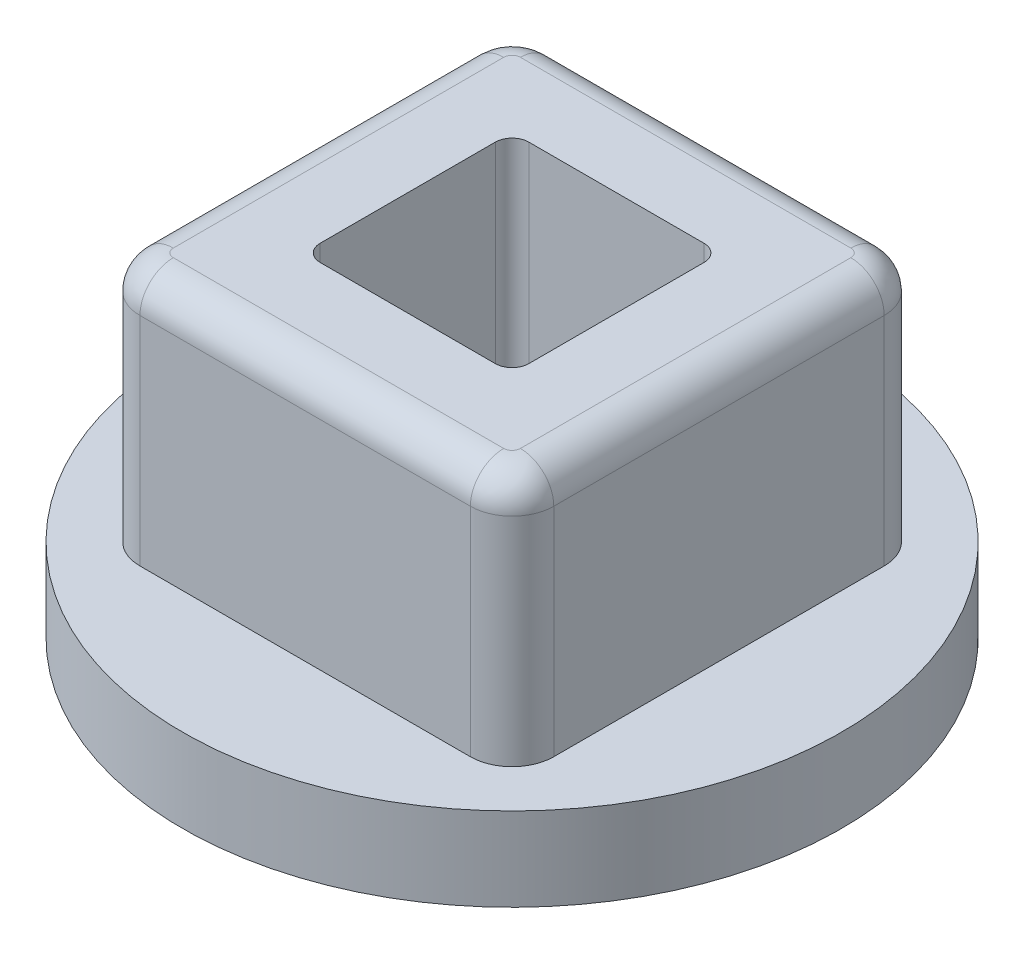
ISO-10303-21;
HEADER;
FILE_DESCRIPTION(('STEP AP214'),'2;1');
FILE_NAME('part.step','',(''),(''),'','','');
FILE_SCHEMA(('AUTOMOTIVE_DESIGN { 1 0 10303 214 1 1 1 1 }'));
ENDSEC;
DATA;
#1=APPLICATION_CONTEXT('core data for automotive mechanical design processes');
#2=APPLICATION_PROTOCOL_DEFINITION('international standard','automotive_design',2000,#1);
#3=PRODUCT_CONTEXT('',#1,'mechanical');
#4=PRODUCT('Part','Part','',(#3));
#5=PRODUCT_RELATED_PRODUCT_CATEGORY('part','',(#4));
#6=PRODUCT_DEFINITION_FORMATION('','',#4);
#7=PRODUCT_DEFINITION_CONTEXT('part definition',#1,'design');
#8=PRODUCT_DEFINITION('design','',#6,#7);
#9=PRODUCT_DEFINITION_SHAPE('','',#8);
#10=(LENGTH_UNIT() NAMED_UNIT(*) SI_UNIT(.MILLI.,.METRE.));
#11=(NAMED_UNIT(*) PLANE_ANGLE_UNIT() SI_UNIT($,.RADIAN.));
#12=(NAMED_UNIT(*) SI_UNIT($,.STERADIAN.) SOLID_ANGLE_UNIT());
#13=UNCERTAINTY_MEASURE_WITH_UNIT(LENGTH_MEASURE(1.E-05),#10,'distance_accuracy_value','');
#14=(GEOMETRIC_REPRESENTATION_CONTEXT(3) GLOBAL_UNCERTAINTY_ASSIGNED_CONTEXT((#13)) GLOBAL_UNIT_ASSIGNED_CONTEXT((#10,
#11,#12)) REPRESENTATION_CONTEXT('',''));
#15=CARTESIAN_POINT('',(0.,0.,0.));
#16=DIRECTION('',(0.,0.,1.));
#17=DIRECTION('',(1.,0.,0.));
#18=AXIS2_PLACEMENT_3D('',#15,#16,#17);
#19=CARTESIAN_POINT('',(-2.5146,5.08,2.5146));
#20=DIRECTION('',(0.,-1.,0.));
#21=DIRECTION('',(0.,0.,-1.));
#22=AXIS2_PLACEMENT_3D('',#19,#20,#21);
#23=CYLINDRICAL_SURFACE('',#22,0.635);
#24=DIRECTION('',(0.,1.,0.));
#25=VECTOR('',#24,1.);
#26=CARTESIAN_POINT('',(-3.1496,5.08,2.51460000000017));
#27=LINE('',#26,#25);
#28=CARTESIAN_POINT('',(-3.14960000000013,4.572,2.5146000000011));
#29=VERTEX_POINT('',#28);
#30=CARTESIAN_POINT('',(-3.1496,1.27,2.51460000000009));
#31=VERTEX_POINT('',#30);
#32=EDGE_CURVE('E98',#29,#31,#27,.F.);
#33=ORIENTED_EDGE('',*,*,#32,.T.);
#34=CARTESIAN_POINT('',(-2.5146,1.27,2.5146));
#35=DIRECTION('',(0.,-1.,0.));
#36=DIRECTION('',(0.,0.,-1.));
#37=AXIS2_PLACEMENT_3D('',#34,#35,#36);
#38=CIRCLE('',#37,0.635);
#39=CARTESIAN_POINT('',(-2.5146,1.27,3.1496));
#40=VERTEX_POINT('',#39);
#41=EDGE_CURVE('E19',#31,#40,#38,.F.);
#42=ORIENTED_EDGE('',*,*,#41,.T.);
#43=DIRECTION('',(0.,1.,0.));
#44=VECTOR('',#43,1.);
#45=CARTESIAN_POINT('',(-2.5146,5.08,3.1496));
#46=LINE('',#45,#44);
#47=CARTESIAN_POINT('',(-2.51460000000036,4.572,3.14959999999985));
#48=VERTEX_POINT('',#47);
#49=EDGE_CURVE('E96',#40,#48,#46,.T.);
#50=ORIENTED_EDGE('',*,*,#49,.T.);
#51=CARTESIAN_POINT('',(-2.51460000000043,4.572,2.51459999999958));
#52=DIRECTION('',(0.,-1.,0.));
#53=DIRECTION('',(0.,0.,-1.));
#54=AXIS2_PLACEMENT_3D('',#51,#52,#53);
#55=CIRCLE('',#54,0.634999999999828);
#56=EDGE_CURVE('E357',#29,#48,#55,.F.);
#57=ORIENTED_EDGE('',*,*,#56,.F.);
#58=EDGE_LOOP('',(#33,#42,#50,#57));
#59=FACE_BOUND('',#58,.T.);
#60=ADVANCED_FACE('F16',(#59),#23,.T.);
#61=CARTESIAN_POINT('',(-2.5146,5.08,-2.5146));
#62=DIRECTION('',(0.,-1.,0.));
#63=DIRECTION('',(0.,0.,-1.));
#64=AXIS2_PLACEMENT_3D('',#61,#62,#63);
#65=CYLINDRICAL_SURFACE('',#64,0.635);
#66=DIRECTION('',(0.,1.,0.));
#67=VECTOR('',#66,1.);
#68=CARTESIAN_POINT('',(-2.51460000000017,5.08,-3.1496));
#69=LINE('',#68,#67);
#70=CARTESIAN_POINT('',(-2.51459999999987,4.572,-3.14960000000006));
#71=VERTEX_POINT('',#70);
#72=CARTESIAN_POINT('',(-2.51460000000009,1.27,-3.1496));
#73=VERTEX_POINT('',#72);
#74=EDGE_CURVE('E245',#71,#73,#69,.F.);
#75=ORIENTED_EDGE('',*,*,#74,.T.);
#76=CARTESIAN_POINT('',(-2.5146,1.27,-2.5146));
#77=DIRECTION('',(0.,-1.,0.));
#78=DIRECTION('',(0.,0.,-1.));
#79=AXIS2_PLACEMENT_3D('',#76,#77,#78);
#80=CIRCLE('',#79,0.635);
#81=CARTESIAN_POINT('',(-3.1496,1.27,-2.5146));
#82=VERTEX_POINT('',#81);
#83=EDGE_CURVE('E100',#73,#82,#80,.F.);
#84=ORIENTED_EDGE('',*,*,#83,.T.);
#85=DIRECTION('',(0.,1.,0.));
#86=VECTOR('',#85,1.);
#87=CARTESIAN_POINT('',(-3.1496,5.08,-2.5146));
#88=LINE('',#87,#86);
#89=CARTESIAN_POINT('',(-3.1495999999997,4.572,-2.5146));
#90=VERTEX_POINT('',#89);
#91=EDGE_CURVE('E258',#82,#90,#88,.T.);
#92=ORIENTED_EDGE('',*,*,#91,.T.);
#93=CARTESIAN_POINT('',(-2.51459999999958,4.572,-2.51460000000043));
#94=DIRECTION('',(0.,-1.,0.));
#95=DIRECTION('',(0.,0.,-1.));
#96=AXIS2_PLACEMENT_3D('',#93,#94,#95);
#97=CIRCLE('',#96,0.634999999999828);
#98=EDGE_CURVE('E271',#71,#90,#97,.F.);
#99=ORIENTED_EDGE('',*,*,#98,.F.);
#100=EDGE_LOOP('',(#75,#84,#92,#99));
#101=FACE_BOUND('',#100,.T.);
#102=ADVANCED_FACE('F432',(#101),#65,.T.);
#103=CARTESIAN_POINT('',(2.5146,5.08,2.5146));
#104=DIRECTION('',(0.,-1.,0.));
#105=DIRECTION('',(0.,0.,-1.));
#106=AXIS2_PLACEMENT_3D('',#103,#104,#105);
#107=CYLINDRICAL_SURFACE('',#106,0.635);
#108=DIRECTION('',(0.,1.,0.));
#109=VECTOR('',#108,1.);
#110=CARTESIAN_POINT('',(2.51460000000009,5.08,3.1496));
#111=LINE('',#110,#109);
#112=CARTESIAN_POINT('',(2.51460000000106,4.572,3.14960000000013));
#113=VERTEX_POINT('',#112);
#114=CARTESIAN_POINT('',(2.51460000000004,1.27,3.1496));
#115=VERTEX_POINT('',#114);
#116=EDGE_CURVE('E261',#113,#115,#111,.F.);
#117=ORIENTED_EDGE('',*,*,#116,.T.);
#118=CARTESIAN_POINT('',(2.5146,1.27,2.5146));
#119=DIRECTION('',(0.,-1.,0.));
#120=DIRECTION('',(0.,0.,-1.));
#121=AXIS2_PLACEMENT_3D('',#118,#119,#120);
#122=CIRCLE('',#121,0.635);
#123=CARTESIAN_POINT('',(3.1496,1.27,2.5146));
#124=VERTEX_POINT('',#123);
#125=EDGE_CURVE('E113',#115,#124,#122,.F.);
#126=ORIENTED_EDGE('',*,*,#125,.T.);
#127=DIRECTION('',(0.,1.,0.));
#128=VECTOR('',#127,1.);
#129=CARTESIAN_POINT('',(3.1496,5.08,2.5146));
#130=LINE('',#129,#128);
#131=CARTESIAN_POINT('',(3.14959999999985,4.572,2.5146));
#132=VERTEX_POINT('',#131);
#133=EDGE_CURVE('E242',#124,#132,#130,.T.);
#134=ORIENTED_EDGE('',*,*,#133,.T.);
#135=CARTESIAN_POINT('',(2.51459999999958,4.572,2.51460000000043));
#136=DIRECTION('',(0.,-1.,0.));
#137=DIRECTION('',(0.,0.,-1.));
#138=AXIS2_PLACEMENT_3D('',#135,#136,#137);
#139=CIRCLE('',#138,0.634999999999828);
#140=EDGE_CURVE('E327',#113,#132,#139,.F.);
#141=ORIENTED_EDGE('',*,*,#140,.F.);
#142=EDGE_LOOP('',(#117,#126,#134,#141));
#143=FACE_BOUND('',#142,.T.);
#144=ADVANCED_FACE('F646',(#143),#107,.T.);
#145=CARTESIAN_POINT('',(2.5146,5.08,-2.5146));
#146=DIRECTION('',(0.,-1.,0.));
#147=DIRECTION('',(0.,0.,-1.));
#148=AXIS2_PLACEMENT_3D('',#145,#146,#147);
#149=CYLINDRICAL_SURFACE('',#148,0.635);
#150=DIRECTION('',(0.,1.,0.));
#151=VECTOR('',#150,1.);
#152=CARTESIAN_POINT('',(3.1496,5.08,-2.51460000000017));
#153=LINE('',#152,#151);
#154=CARTESIAN_POINT('',(3.14960000000013,4.572,-2.5146000000011));
#155=VERTEX_POINT('',#154);
#156=CARTESIAN_POINT('',(3.1496,1.27,-2.51460000000009));
#157=VERTEX_POINT('',#156);
#158=EDGE_CURVE('E235',#155,#157,#153,.F.);
#159=ORIENTED_EDGE('',*,*,#158,.T.);
#160=CARTESIAN_POINT('',(2.5146,1.27,-2.5146));
#161=DIRECTION('',(0.,-1.,0.));
#162=DIRECTION('',(0.,0.,-1.));
#163=AXIS2_PLACEMENT_3D('',#160,#161,#162);
#164=CIRCLE('',#163,0.635);
#165=CARTESIAN_POINT('',(2.5146,1.27,-3.1496));
#166=VERTEX_POINT('',#165);
#167=EDGE_CURVE('E378',#157,#166,#164,.F.);
#168=ORIENTED_EDGE('',*,*,#167,.T.);
#169=DIRECTION('',(0.,1.,0.));
#170=VECTOR('',#169,1.);
#171=CARTESIAN_POINT('',(2.5146,5.08,-3.1496));
#172=LINE('',#171,#170);
#173=CARTESIAN_POINT('',(2.51460000000011,4.572,-3.14959999999985));
#174=VERTEX_POINT('',#173);
#175=EDGE_CURVE('E248',#166,#174,#172,.T.);
#176=ORIENTED_EDGE('',*,*,#175,.T.);
#177=CARTESIAN_POINT('',(2.51460000000043,4.572,-2.51459999999958));
#178=DIRECTION('',(0.,-1.,0.));
#179=DIRECTION('',(0.,0.,-1.));
#180=AXIS2_PLACEMENT_3D('',#177,#178,#179);
#181=CIRCLE('',#180,0.634999999999828);
#182=EDGE_CURVE('E298',#155,#174,#181,.F.);
#183=ORIENTED_EDGE('',*,*,#182,.F.);
#184=EDGE_LOOP('',(#159,#168,#176,#183));
#185=FACE_BOUND('',#184,.T.);
#186=ADVANCED_FACE('F498',(#185),#149,.T.);
#187=CARTESIAN_POINT('',(-2.6416,4.572,2.538898108304));
#188=DIRECTION('',(0.,0.,-1.));
#189=DIRECTION('',(-1.,0.,0.));
#190=AXIS2_PLACEMENT_3D('',#187,#188,#189);
#191=CYLINDRICAL_SURFACE('',#190,0.508);
#192=CARTESIAN_POINT('',(-2.64160000000059,4.57200000000093,2.51460000000007));
#193=DIRECTION('',(-3.86198346587602E-12,0.,-1.));
#194=DIRECTION('',(-1.,0.,3.86198346587602E-12));
#195=AXIS2_PLACEMENT_3D('',#192,#193,#194);
#196=CIRCLE('',#195,0.507999999999662);
#197=CARTESIAN_POINT('',(-2.6415999981047,5.08000000000029,2.51460000000007));
#198=VERTEX_POINT('',#197);
#199=EDGE_CURVE('E202',#198,#29,#196,.F.);
#200=ORIENTED_EDGE('',*,*,#199,.F.);
#201=DIRECTION('',(0.,0.,1.));
#202=VECTOR('',#201,1.);
#203=CARTESIAN_POINT('',(-2.6416,5.08,3.1496));
#204=LINE('',#203,#202);
#205=CARTESIAN_POINT('',(-2.64159999999994,5.08000000000029,-2.51460000000017));
#206=VERTEX_POINT('',#205);
#207=EDGE_CURVE('E188',#206,#198,#204,.T.);
#208=ORIENTED_EDGE('',*,*,#207,.F.);
#209=CARTESIAN_POINT('',(-2.64159999999975,4.57200000000093,-2.51460000000034));
#210=DIRECTION('',(-6.69870225473767E-13,0.,-1.));
#211=DIRECTION('',(-1.,0.,6.69870225473767E-13));
#212=AXIS2_PLACEMENT_3D('',#209,#210,#211);
#213=CIRCLE('',#212,0.507999999999662);
#214=EDGE_CURVE('E109',#90,#206,#213,.T.);
#215=ORIENTED_EDGE('',*,*,#214,.F.);
#216=DIRECTION('',(0.,0.,-1.));
#217=VECTOR('',#216,1.);
#218=CARTESIAN_POINT('',(-3.1496,4.572,-3.1496));
#219=LINE('',#218,#217);
#220=EDGE_CURVE('E255',#90,#29,#219,.F.);
#221=ORIENTED_EDGE('',*,*,#220,.T.);
#222=EDGE_LOOP('',(#200,#208,#215,#221));
#223=FACE_BOUND('',#222,.T.);
#224=ADVANCED_FACE('F199',(#223),#191,.T.);
#225=CARTESIAN_POINT('',(-2.51460000000043,4.57200000000093,2.38759999999941));
#226=DIRECTION('',(1.,0.,0.));
#227=DIRECTION('',(0.,0.,-1.));
#228=AXIS2_PLACEMENT_3D('',#225,#226,#227);
#229=CIRCLE('',#228,0.507999999999662);
#230=TRIMMED_CURVE('',#229,(PARAMETER_VALUE(-1.82347658193748)),
(PARAMETER_VALUE(1.82347658193748)),.T.,.PARAMETER.);
#231=CARTESIAN_POINT('',(-2.51460000000043,4.57200000000093,2.51459999999958));
#232=DIRECTION('',(0.,-1.,0.));
#233=AXIS1_PLACEMENT('',#231,#232);
#234=SURFACE_OF_REVOLUTION('',#230,#233);
#235=CARTESIAN_POINT('',(-2.51460000000014,4.572,2.6416));
#236=DIRECTION('',(-1.,0.,0.));
#237=DIRECTION('',(0.,0.,1.));
#238=AXIS2_PLACEMENT_3D('',#235,#236,#237);
#239=CIRCLE('',#238,0.508);
#240=CARTESIAN_POINT('',(-2.51460000000025,5.08000000000015,2.64159999778818));
#241=VERTEX_POINT('',#240);
#242=EDGE_CURVE('E352',#241,#48,#239,.F.);
#243=ORIENTED_EDGE('',*,*,#242,.F.);
#244=CARTESIAN_POINT('',(-2.51460000000043,5.08000000000059,2.51459999999958));
#245=DIRECTION('',(0.,-1.,0.));
#246=DIRECTION('',(-1.37958325052589E-12,0.,1.));
#247=AXIS2_PLACEMENT_3D('',#244,#245,#246);
#248=CIRCLE('',#247,0.126999998736481);
#249=EDGE_CURVE('E131',#198,#241,#248,.F.);
#250=ORIENTED_EDGE('',*,*,#249,.F.);
#251=ORIENTED_EDGE('',*,*,#199,.T.);
#252=ORIENTED_EDGE('',*,*,#56,.T.);
#253=EDGE_LOOP('',(#243,#250,#251,#252));
#254=FACE_BOUND('',#253,.T.);
#255=ADVANCED_FACE('F363',(#254),#234,.F.);
#256=CARTESIAN_POINT('',(2.538898108304,4.572,2.6416));
#257=DIRECTION('',(-1.,0.,0.));
#258=DIRECTION('',(0.,0.,1.));
#259=AXIS2_PLACEMENT_3D('',#256,#257,#258);
#260=CYLINDRICAL_SURFACE('',#259,0.508);
#261=CARTESIAN_POINT('',(2.51460000000007,4.57200000000093,2.64160000000059));
#262=DIRECTION('',(-1.,0.,3.86902766089366E-12));
#263=DIRECTION('',(3.86902766089366E-12,0.,1.));
#264=AXIS2_PLACEMENT_3D('',#261,#262,#263);
#265=CIRCLE('',#264,0.507999999999662);
#266=CARTESIAN_POINT('',(2.51460000000007,5.08000000000029,2.64159999873631));
#267=VERTEX_POINT('',#266);
#268=EDGE_CURVE('E344',#267,#113,#265,.F.);
#269=ORIENTED_EDGE('',*,*,#268,.F.);
#270=DIRECTION('',(1.,0.,0.));
#271=VECTOR('',#270,1.);
#272=CARTESIAN_POINT('',(-3.1496,5.08,2.64159999747237));
#273=LINE('',#272,#271);
#274=EDGE_CURVE('E205',#241,#267,#273,.T.);
#275=ORIENTED_EDGE('',*,*,#274,.F.);
#276=ORIENTED_EDGE('',*,*,#242,.T.);
#277=DIRECTION('',(-1.,0.,0.));
#278=VECTOR('',#277,1.);
#279=CARTESIAN_POINT('',(-3.1496,4.572,3.1496));
#280=LINE('',#279,#278);
#281=EDGE_CURVE('E108',#48,#113,#280,.F.);
#282=ORIENTED_EDGE('',*,*,#281,.T.);
#283=EDGE_LOOP('',(#269,#275,#276,#282));
#284=FACE_BOUND('',#283,.T.);
#285=ADVANCED_FACE('F338',(#284),#260,.T.);
#286=CARTESIAN_POINT('',(2.51459999999958,4.57200000000093,2.38760000000026));
#287=DIRECTION('',(1.,0.,0.));
#288=DIRECTION('',(0.,0.,-1.));
#289=AXIS2_PLACEMENT_3D('',#286,#287,#288);
#290=CIRCLE('',#289,0.507999999999662);
#291=TRIMMED_CURVE('',#290,(PARAMETER_VALUE(-1.82347658193748)),
(PARAMETER_VALUE(1.82347658193748)),.T.,.PARAMETER.);
#292=CARTESIAN_POINT('',(2.51459999999958,4.57200000000093,2.51460000000043));
#293=DIRECTION('',(0.,-1.,0.));
#294=AXIS1_PLACEMENT('',#292,#293);
#295=SURFACE_OF_REVOLUTION('',#291,#294);
#296=CARTESIAN_POINT('',(2.6416,4.572,2.5146));
#297=DIRECTION('',(0.,0.,1.));
#298=DIRECTION('',(1.,0.,0.));
#299=AXIS2_PLACEMENT_3D('',#296,#297,#298);
#300=CIRCLE('',#299,0.508);
#301=CARTESIAN_POINT('',(2.64159999936797,5.08000000000015,2.51460000000008));
#302=VERTEX_POINT('',#301);
#303=EDGE_CURVE('E322',#302,#132,#300,.F.);
#304=ORIENTED_EDGE('',*,*,#303,.F.);
#305=CARTESIAN_POINT('',(2.51459999999958,5.08000000000059,2.51460000000043));
#306=DIRECTION('',(0.,-1.,0.));
#307=DIRECTION('',(1.,0.,-6.72717568438272E-13));
#308=AXIS2_PLACEMENT_3D('',#305,#306,#307);
#309=CIRCLE('',#308,0.127000000000293);
#310=EDGE_CURVE('E512',#267,#302,#309,.F.);
#311=ORIENTED_EDGE('',*,*,#310,.F.);
#312=ORIENTED_EDGE('',*,*,#268,.T.);
#313=ORIENTED_EDGE('',*,*,#140,.T.);
#314=EDGE_LOOP('',(#304,#311,#312,#313));
#315=FACE_BOUND('',#314,.T.);
#316=ADVANCED_FACE('F334',(#315),#295,.F.);
#317=CARTESIAN_POINT('',(2.6416,4.572,-2.538898108304));
#318=DIRECTION('',(0.,0.,1.));
#319=DIRECTION('',(1.,0.,0.));
#320=AXIS2_PLACEMENT_3D('',#317,#318,#319);
#321=CYLINDRICAL_SURFACE('',#320,0.508);
#322=CARTESIAN_POINT('',(2.64160000000059,4.57200000000093,-2.51460000000007));
#323=DIRECTION('',(3.86563575947983E-12,0.,1.));
#324=DIRECTION('',(1.,0.,-3.86563575947983E-12));
#325=AXIS2_PLACEMENT_3D('',#322,#323,#324);
#326=CIRCLE('',#325,0.507999999999662);
#327=CARTESIAN_POINT('',(2.64159999873636,5.08000000000029,-2.51460000000007));
#328=VERTEX_POINT('',#327);
#329=EDGE_CURVE('E314',#328,#155,#326,.F.);
#330=ORIENTED_EDGE('',*,*,#329,.F.);
#331=DIRECTION('',(0.,0.,1.));
#332=VECTOR('',#331,1.);
#333=CARTESIAN_POINT('',(2.6416,5.08,3.1496));
#334=LINE('',#333,#332);
#335=EDGE_CURVE('E516',#302,#328,#334,.F.);
#336=ORIENTED_EDGE('',*,*,#335,.F.);
#337=ORIENTED_EDGE('',*,*,#303,.T.);
#338=DIRECTION('',(0.,0.,1.));
#339=VECTOR('',#338,1.);
#340=CARTESIAN_POINT('',(3.1496,4.572,-3.1496));
#341=LINE('',#340,#339);
#342=EDGE_CURVE('E239',#132,#155,#341,.F.);
#343=ORIENTED_EDGE('',*,*,#342,.T.);
#344=EDGE_LOOP('',(#330,#336,#337,#343));
#345=FACE_BOUND('',#344,.T.);
#346=ADVANCED_FACE('F308',(#345),#321,.T.);
#347=CARTESIAN_POINT('',(2.51460000000043,4.57200000000093,-2.64159999999975));
#348=DIRECTION('',(1.,0.,0.));
#349=DIRECTION('',(0.,0.,-1.));
#350=AXIS2_PLACEMENT_3D('',#347,#348,#349);
#351=CIRCLE('',#350,0.507999999999662);
#352=TRIMMED_CURVE('',#351,(PARAMETER_VALUE(-1.82347658193748)),
(PARAMETER_VALUE(1.82347658193748)),.T.,.PARAMETER.);
#353=CARTESIAN_POINT('',(2.51460000000043,4.57200000000093,-2.51459999999958));
#354=DIRECTION('',(0.,-1.,0.));
#355=AXIS1_PLACEMENT('',#353,#354);
#356=SURFACE_OF_REVOLUTION('',#352,#355);
#357=CARTESIAN_POINT('',(2.5146,4.572,-2.6416));
#358=DIRECTION('',(1.,0.,0.));
#359=DIRECTION('',(0.,0.,-1.));
#360=AXIS2_PLACEMENT_3D('',#357,#358,#359);
#361=CIRCLE('',#360,0.508);
#362=CARTESIAN_POINT('',(2.51460000000011,5.08000000000015,-2.64159999936809));
#363=VERTEX_POINT('',#362);
#364=EDGE_CURVE('E294',#363,#174,#361,.F.);
#365=ORIENTED_EDGE('',*,*,#364,.F.);
#366=CARTESIAN_POINT('',(2.51460000000043,5.08000000000059,-2.51459999999958));
#367=DIRECTION('',(0.,-1.,0.));
#368=DIRECTION('',(0.,0.,-1.));
#369=AXIS2_PLACEMENT_3D('',#366,#367,#368);
#370=CIRCLE('',#369,0.127000000000293);
#371=EDGE_CURVE('E174',#328,#363,#370,.F.);
#372=ORIENTED_EDGE('',*,*,#371,.F.);
#373=ORIENTED_EDGE('',*,*,#329,.T.);
#374=ORIENTED_EDGE('',*,*,#182,.T.);
#375=EDGE_LOOP('',(#365,#372,#373,#374));
#376=FACE_BOUND('',#375,.T.);
#377=ADVANCED_FACE('F304',(#376),#356,.F.);
#378=CARTESIAN_POINT('',(-2.538898108304,4.572,-2.6416));
#379=DIRECTION('',(1.,0.,0.));
#380=DIRECTION('',(0.,0.,-1.));
#381=AXIS2_PLACEMENT_3D('',#378,#379,#380);
#382=CYLINDRICAL_SURFACE('',#381,0.508);
#383=CARTESIAN_POINT('',(-2.51460000000017,4.572,-2.6416));
#384=DIRECTION('',(1.,0.,0.));
#385=DIRECTION('',(0.,0.,-1.));
#386=AXIS2_PLACEMENT_3D('',#383,#384,#385);
#387=CIRCLE('',#386,0.508);
#388=CARTESIAN_POINT('',(-2.51459999999989,5.08000000000024,-2.64159999797814));
#389=VERTEX_POINT('',#388);
#390=EDGE_CURVE('E297',#389,#71,#387,.F.);
#391=ORIENTED_EDGE('',*,*,#390,.F.);
#392=DIRECTION('',(1.,0.,0.));
#393=VECTOR('',#392,1.);
#394=CARTESIAN_POINT('',(-3.1496,5.08,-2.6416));
#395=LINE('',#394,#393);
#396=EDGE_CURVE('E121',#363,#389,#395,.F.);
#397=ORIENTED_EDGE('',*,*,#396,.F.);
#398=ORIENTED_EDGE('',*,*,#364,.T.);
#399=DIRECTION('',(1.,0.,0.));
#400=VECTOR('',#399,1.);
#401=CARTESIAN_POINT('',(-3.1496,4.572,-3.1496));
#402=LINE('',#401,#400);
#403=EDGE_CURVE('E251',#174,#71,#402,.F.);
#404=ORIENTED_EDGE('',*,*,#403,.T.);
#405=EDGE_LOOP('',(#391,#397,#398,#404));
#406=FACE_BOUND('',#405,.T.);
#407=ADVANCED_FACE('F279',(#406),#382,.T.);
#408=CARTESIAN_POINT('',(-2.51459999999958,4.57200000000093,-2.64160000000059));
#409=DIRECTION('',(1.,0.,0.));
#410=DIRECTION('',(0.,0.,-1.));
#411=AXIS2_PLACEMENT_3D('',#408,#409,#410);
#412=CIRCLE('',#411,0.507999999999662);
#413=TRIMMED_CURVE('',#412,(PARAMETER_VALUE(-1.82347658193748)),
(PARAMETER_VALUE(1.82347658193748)),.T.,.PARAMETER.);
#414=CARTESIAN_POINT('',(-2.51459999999958,4.57200000000093,-2.51460000000043));
#415=DIRECTION('',(0.,-1.,0.));
#416=AXIS1_PLACEMENT('',#414,#415);
#417=SURFACE_OF_REVOLUTION('',#413,#416);
#418=ORIENTED_EDGE('',*,*,#214,.T.);
#419=CARTESIAN_POINT('',(-2.51459999999958,5.08000000000059,-2.51460000000043));
#420=DIRECTION('',(0.,-1.,0.));
#421=DIRECTION('',(-1.,0.,6.72717568438272E-13));
#422=AXIS2_PLACEMENT_3D('',#419,#420,#421);
#423=CIRCLE('',#422,0.127000000000293);
#424=EDGE_CURVE('E116',#389,#206,#423,.F.);
#425=ORIENTED_EDGE('',*,*,#424,.F.);
#426=ORIENTED_EDGE('',*,*,#390,.T.);
#427=ORIENTED_EDGE('',*,*,#98,.T.);
#428=EDGE_LOOP('',(#418,#425,#426,#427));
#429=FACE_BOUND('',#428,.T.);
#430=ADVANCED_FACE('F274',(#429),#417,.F.);
#431=CARTESIAN_POINT('',(-3.1496,5.08,3.1496));
#432=DIRECTION('',(0.,0.,-1.));
#433=DIRECTION('',(-1.,0.,0.));
#434=AXIS2_PLACEMENT_3D('',#431,#432,#433);
#435=PLANE('',#434);
#436=ORIENTED_EDGE('',*,*,#116,.F.);
#437=ORIENTED_EDGE('',*,*,#281,.F.);
#438=ORIENTED_EDGE('',*,*,#49,.F.);
#439=DIRECTION('',(1.,0.,0.));
#440=VECTOR('',#439,1.);
#441=CARTESIAN_POINT('',(0.,1.27,3.1496));
#442=LINE('',#441,#440);
#443=EDGE_CURVE('E106',#115,#40,#442,.F.);
#444=ORIENTED_EDGE('',*,*,#443,.F.);
#445=EDGE_LOOP('',(#436,#437,#438,#444));
#446=FACE_BOUND('',#445,.T.);
#447=ADVANCED_FACE('F105',(#446),#435,.F.);
#448=CARTESIAN_POINT('',(-3.1496,5.08,-3.1496));
#449=DIRECTION('',(1.,0.,0.));
#450=DIRECTION('',(0.,0.,-1.));
#451=AXIS2_PLACEMENT_3D('',#448,#449,#450);
#452=PLANE('',#451);
#453=ORIENTED_EDGE('',*,*,#32,.F.);
#454=ORIENTED_EDGE('',*,*,#220,.F.);
#455=ORIENTED_EDGE('',*,*,#91,.F.);
#456=DIRECTION('',(0.,0.,1.));
#457=VECTOR('',#456,1.);
#458=CARTESIAN_POINT('',(-3.1496,1.27,0.));
#459=LINE('',#458,#457);
#460=EDGE_CURVE('E115',#31,#82,#459,.F.);
#461=ORIENTED_EDGE('',*,*,#460,.F.);
#462=EDGE_LOOP('',(#453,#454,#455,#461));
#463=FACE_BOUND('',#462,.T.);
#464=ADVANCED_FACE('F439',(#463),#452,.F.);
#465=CARTESIAN_POINT('',(-3.1496,5.08,-3.1496));
#466=DIRECTION('',(0.,0.,1.));
#467=DIRECTION('',(1.,0.,0.));
#468=AXIS2_PLACEMENT_3D('',#465,#466,#467);
#469=PLANE('',#468);
#470=ORIENTED_EDGE('',*,*,#74,.F.);
#471=ORIENTED_EDGE('',*,*,#403,.F.);
#472=ORIENTED_EDGE('',*,*,#175,.F.);
#473=DIRECTION('',(1.,0.,0.));
#474=VECTOR('',#473,1.);
#475=CARTESIAN_POINT('',(0.,1.27,-3.1496));
#476=LINE('',#475,#474);
#477=EDGE_CURVE('E118',#73,#166,#476,.T.);
#478=ORIENTED_EDGE('',*,*,#477,.F.);
#479=EDGE_LOOP('',(#470,#471,#472,#478));
#480=FACE_BOUND('',#479,.T.);
#481=ADVANCED_FACE('F493',(#480),#469,.F.);
#482=CARTESIAN_POINT('',(3.1496,5.08,-3.1496));
#483=DIRECTION('',(-1.,0.,0.));
#484=DIRECTION('',(0.,0.,1.));
#485=AXIS2_PLACEMENT_3D('',#482,#483,#484);
#486=PLANE('',#485);
#487=ORIENTED_EDGE('',*,*,#158,.F.);
#488=ORIENTED_EDGE('',*,*,#342,.F.);
#489=ORIENTED_EDGE('',*,*,#133,.F.);
#490=DIRECTION('',(0.,0.,1.));
#491=VECTOR('',#490,1.);
#492=CARTESIAN_POINT('',(3.1496,1.27,0.));
#493=LINE('',#492,#491);
#494=EDGE_CURVE('E488',#157,#124,#493,.T.);
#495=ORIENTED_EDGE('',*,*,#494,.F.);
#496=EDGE_LOOP('',(#487,#488,#489,#495));
#497=FACE_BOUND('',#496,.T.);
#498=ADVANCED_FACE('F584',(#497),#486,.F.);
#499=CARTESIAN_POINT('',(1.3335,5.08,-1.3335));
#500=DIRECTION('',(0.,1.,0.));
#501=DIRECTION('',(0.,0.,1.));
#502=AXIS2_PLACEMENT_3D('',#499,#500,#501);
#503=CYLINDRICAL_SURFACE('',#502,0.254);
#504=DIRECTION('',(0.,1.,0.));
#505=VECTOR('',#504,1.);
#506=CARTESIAN_POINT('',(1.5875,5.08,-1.3335));
#507=LINE('',#506,#505);
#508=CARTESIAN_POINT('',(1.5875,0.,-1.3335));
#509=VERTEX_POINT('',#508);
#510=CARTESIAN_POINT('',(1.5875,5.08,-1.3335));
#511=VERTEX_POINT('',#510);
#512=EDGE_CURVE('E229',#509,#511,#507,.T.);
#513=ORIENTED_EDGE('',*,*,#512,.T.);
#514=CARTESIAN_POINT('',(1.3335,5.08,-1.3335));
#515=DIRECTION('',(0.,1.,0.));
#516=DIRECTION('',(0.,0.,1.));
#517=AXIS2_PLACEMENT_3D('',#514,#515,#516);
#518=CIRCLE('',#517,0.254);
#519=CARTESIAN_POINT('',(1.3335,5.08,-1.5875));
#520=VERTEX_POINT('',#519);
#521=EDGE_CURVE('E203',#520,#511,#518,.F.);
#522=ORIENTED_EDGE('',*,*,#521,.F.);
#523=DIRECTION('',(0.,1.,0.));
#524=VECTOR('',#523,1.);
#525=CARTESIAN_POINT('',(1.3335,5.08,-1.5875));
#526=LINE('',#525,#524);
#527=CARTESIAN_POINT('',(1.3335,0.,-1.5875));
#528=VERTEX_POINT('',#527);
#529=EDGE_CURVE('E233',#520,#528,#526,.F.);
#530=ORIENTED_EDGE('',*,*,#529,.T.);
#531=CARTESIAN_POINT('',(1.3335,0.,-1.3335));
#532=DIRECTION('',(0.,1.,0.));
#533=DIRECTION('',(0.,0.,1.));
#534=AXIS2_PLACEMENT_3D('',#531,#532,#533);
#535=CIRCLE('',#534,0.254);
#536=EDGE_CURVE('E238',#509,#528,#535,.T.);
#537=ORIENTED_EDGE('',*,*,#536,.F.);
#538=EDGE_LOOP('',(#513,#522,#530,#537));
#539=FACE_BOUND('',#538,.T.);
#540=ADVANCED_FACE('F582',(#539),#503,.F.);
#541=CARTESIAN_POINT('',(1.3335,5.08,1.3335));
#542=DIRECTION('',(0.,1.,0.));
#543=DIRECTION('',(0.,0.,1.));
#544=AXIS2_PLACEMENT_3D('',#541,#542,#543);
#545=CYLINDRICAL_SURFACE('',#544,0.254);
#546=DIRECTION('',(0.,1.,0.));
#547=VECTOR('',#546,1.);
#548=CARTESIAN_POINT('',(1.3335,5.08,1.5875));
#549=LINE('',#548,#547);
#550=CARTESIAN_POINT('',(1.3335,0.,1.5875));
#551=VERTEX_POINT('',#550);
#552=CARTESIAN_POINT('',(1.3335,5.08,1.5875));
#553=VERTEX_POINT('',#552);
#554=EDGE_CURVE('E224',#551,#553,#549,.T.);
#555=ORIENTED_EDGE('',*,*,#554,.T.);
#556=CARTESIAN_POINT('',(1.3335,5.08,1.3335));
#557=DIRECTION('',(0.,1.,0.));
#558=DIRECTION('',(0.,0.,1.));
#559=AXIS2_PLACEMENT_3D('',#556,#557,#558);
#560=CIRCLE('',#559,0.254);
#561=CARTESIAN_POINT('',(1.5875,5.08,1.3335));
#562=VERTEX_POINT('',#561);
#563=EDGE_CURVE('E415',#562,#553,#560,.F.);
#564=ORIENTED_EDGE('',*,*,#563,.F.);
#565=DIRECTION('',(0.,1.,0.));
#566=VECTOR('',#565,1.);
#567=CARTESIAN_POINT('',(1.5875,5.08,1.3335));
#568=LINE('',#567,#566);
#569=CARTESIAN_POINT('',(1.5875,0.,1.3335));
#570=VERTEX_POINT('',#569);
#571=EDGE_CURVE('E228',#562,#570,#568,.F.);
#572=ORIENTED_EDGE('',*,*,#571,.T.);
#573=CARTESIAN_POINT('',(1.3335,0.,1.3335));
#574=DIRECTION('',(0.,1.,0.));
#575=DIRECTION('',(0.,0.,1.));
#576=AXIS2_PLACEMENT_3D('',#573,#574,#575);
#577=CIRCLE('',#576,0.254);
#578=EDGE_CURVE('E421',#551,#570,#577,.T.);
#579=ORIENTED_EDGE('',*,*,#578,.F.);
#580=EDGE_LOOP('',(#555,#564,#572,#579));
#581=FACE_BOUND('',#580,.T.);
#582=ADVANCED_FACE('F476',(#581),#545,.F.);
#583=CARTESIAN_POINT('',(-1.3335,5.08,-1.3335));
#584=DIRECTION('',(0.,1.,0.));
#585=DIRECTION('',(0.,0.,1.));
#586=AXIS2_PLACEMENT_3D('',#583,#584,#585);
#587=CYLINDRICAL_SURFACE('',#586,0.254);
#588=DIRECTION('',(0.,1.,0.));
#589=VECTOR('',#588,1.);
#590=CARTESIAN_POINT('',(-1.3335,5.08,-1.5875));
#591=LINE('',#590,#589);
#592=CARTESIAN_POINT('',(-1.3335,0.,-1.5875));
#593=VERTEX_POINT('',#592);
#594=CARTESIAN_POINT('',(-1.3335,5.08,-1.5875));
#595=VERTEX_POINT('',#594);
#596=EDGE_CURVE('E234',#593,#595,#591,.T.);
#597=ORIENTED_EDGE('',*,*,#596,.T.);
#598=CARTESIAN_POINT('',(-1.3335,5.08,-1.3335));
#599=DIRECTION('',(0.,1.,0.));
#600=DIRECTION('',(0.,0.,1.));
#601=AXIS2_PLACEMENT_3D('',#598,#599,#600);
#602=CIRCLE('',#601,0.254);
#603=CARTESIAN_POINT('',(-1.5875,5.08,-1.3335));
#604=VERTEX_POINT('',#603);
#605=EDGE_CURVE('E207',#604,#595,#602,.F.);
#606=ORIENTED_EDGE('',*,*,#605,.F.);
#607=DIRECTION('',(0.,1.,0.));
#608=VECTOR('',#607,1.);
#609=CARTESIAN_POINT('',(-1.5875,5.08,-1.3335));
#610=LINE('',#609,#608);
#611=CARTESIAN_POINT('',(-1.5875,0.,-1.3335));
#612=VERTEX_POINT('',#611);
#613=EDGE_CURVE('E481',#604,#612,#610,.F.);
#614=ORIENTED_EDGE('',*,*,#613,.T.);
#615=CARTESIAN_POINT('',(-1.3335,0.,-1.3335));
#616=DIRECTION('',(0.,1.,0.));
#617=DIRECTION('',(0.,0.,1.));
#618=AXIS2_PLACEMENT_3D('',#615,#616,#617);
#619=CIRCLE('',#618,0.254);
#620=EDGE_CURVE('E419',#593,#612,#619,.T.);
#621=ORIENTED_EDGE('',*,*,#620,.F.);
#622=EDGE_LOOP('',(#597,#606,#614,#621));
#623=FACE_BOUND('',#622,.T.);
#624=ADVANCED_FACE('F570',(#623),#587,.F.);
#625=CARTESIAN_POINT('',(-1.3335,5.08,1.3335));
#626=DIRECTION('',(0.,1.,0.));
#627=DIRECTION('',(0.,0.,1.));
#628=AXIS2_PLACEMENT_3D('',#625,#626,#627);
#629=CYLINDRICAL_SURFACE('',#628,0.254);
#630=DIRECTION('',(0.,1.,0.));
#631=VECTOR('',#630,1.);
#632=CARTESIAN_POINT('',(-1.5875,5.08,1.3335));
#633=LINE('',#632,#631);
#634=CARTESIAN_POINT('',(-1.5875,0.,1.3335));
#635=VERTEX_POINT('',#634);
#636=CARTESIAN_POINT('',(-1.5875,5.08,1.3335));
#637=VERTEX_POINT('',#636);
#638=EDGE_CURVE('E219',#635,#637,#633,.T.);
#639=ORIENTED_EDGE('',*,*,#638,.T.);
#640=CARTESIAN_POINT('',(-1.3335,5.08,1.3335));
#641=DIRECTION('',(0.,1.,0.));
#642=DIRECTION('',(0.,0.,1.));
#643=AXIS2_PLACEMENT_3D('',#640,#641,#642);
#644=CIRCLE('',#643,0.254);
#645=CARTESIAN_POINT('',(-1.3335,5.08,1.5875));
#646=VERTEX_POINT('',#645);
#647=EDGE_CURVE('E412',#646,#637,#644,.F.);
#648=ORIENTED_EDGE('',*,*,#647,.F.);
#649=DIRECTION('',(0.,1.,0.));
#650=VECTOR('',#649,1.);
#651=CARTESIAN_POINT('',(-1.3335,5.08,1.5875));
#652=LINE('',#651,#650);
#653=CARTESIAN_POINT('',(-1.3335,0.,1.5875));
#654=VERTEX_POINT('',#653);
#655=EDGE_CURVE('E223',#646,#654,#652,.F.);
#656=ORIENTED_EDGE('',*,*,#655,.T.);
#657=CARTESIAN_POINT('',(-1.3335,0.,1.3335));
#658=DIRECTION('',(0.,1.,0.));
#659=DIRECTION('',(0.,0.,1.));
#660=AXIS2_PLACEMENT_3D('',#657,#658,#659);
#661=CIRCLE('',#660,0.254);
#662=EDGE_CURVE('E34',#635,#654,#661,.T.);
#663=ORIENTED_EDGE('',*,*,#662,.F.);
#664=EDGE_LOOP('',(#639,#648,#656,#663));
#665=FACE_BOUND('',#664,.T.);
#666=ADVANCED_FACE('F149',(#665),#629,.F.);
#667=CARTESIAN_POINT('',(-3.1496,5.08,3.1496));
#668=DIRECTION('',(0.,1.,0.));
#669=DIRECTION('',(0.,0.,1.));
#670=AXIS2_PLACEMENT_3D('',#667,#668,#669);
#671=PLANE('',#670);
#672=ORIENTED_EDGE('',*,*,#396,.T.);
#673=ORIENTED_EDGE('',*,*,#424,.T.);
#674=ORIENTED_EDGE('',*,*,#207,.T.);
#675=ORIENTED_EDGE('',*,*,#249,.T.);
#676=ORIENTED_EDGE('',*,*,#274,.T.);
#677=ORIENTED_EDGE('',*,*,#310,.T.);
#678=ORIENTED_EDGE('',*,*,#335,.T.);
#679=ORIENTED_EDGE('',*,*,#371,.T.);
#680=EDGE_LOOP('',(#672,#673,#674,#675,#676,#677,#678,#679));
#681=FACE_BOUND('',#680,.T.);
#682=ORIENTED_EDGE('',*,*,#521,.T.);
#683=DIRECTION('',(0.,0.,-1.));
#684=VECTOR('',#683,1.);
#685=CARTESIAN_POINT('',(1.5875,5.08,1.5875));
#686=LINE('',#685,#684);
#687=EDGE_CURVE('E225',#511,#562,#686,.F.);
#688=ORIENTED_EDGE('',*,*,#687,.T.);
#689=ORIENTED_EDGE('',*,*,#563,.T.);
#690=DIRECTION('',(1.,0.,0.));
#691=VECTOR('',#690,1.);
#692=CARTESIAN_POINT('',(-1.5875,5.08,1.5875));
#693=LINE('',#692,#691);
#694=EDGE_CURVE('E220',#553,#646,#693,.F.);
#695=ORIENTED_EDGE('',*,*,#694,.T.);
#696=ORIENTED_EDGE('',*,*,#647,.T.);
#697=DIRECTION('',(0.,0.,1.));
#698=VECTOR('',#697,1.);
#699=CARTESIAN_POINT('',(-1.5875,5.08,1.5875));
#700=LINE('',#699,#698);
#701=EDGE_CURVE('E215',#637,#604,#700,.F.);
#702=ORIENTED_EDGE('',*,*,#701,.T.);
#703=ORIENTED_EDGE('',*,*,#605,.T.);
#704=DIRECTION('',(-1.,0.,0.));
#705=VECTOR('',#704,1.);
#706=CARTESIAN_POINT('',(-1.5875,5.08,-1.5875));
#707=LINE('',#706,#705);
#708=EDGE_CURVE('E230',#595,#520,#707,.F.);
#709=ORIENTED_EDGE('',*,*,#708,.T.);
#710=EDGE_LOOP('',(#682,#688,#689,#695,#696,#702,#703,#709));
#711=FACE_BOUND('',#710,.T.);
#712=ADVANCED_FACE('F139',(#681,#711),#671,.T.);
#713=CARTESIAN_POINT('',(0.,1.27,0.));
#714=DIRECTION('',(0.,1.,0.));
#715=DIRECTION('',(0.,0.,1.));
#716=AXIS2_PLACEMENT_3D('',#713,#714,#715);
#717=PLANE('',#716);
#718=CARTESIAN_POINT('',(0.,1.27,0.));
#719=DIRECTION('',(0.,-1.,0.));
#720=DIRECTION('',(0.,0.,-1.));
#721=AXIS2_PLACEMENT_3D('',#718,#719,#720);
#722=CIRCLE('',#721,5.0165);
#723=CARTESIAN_POINT('',(0.,1.27,-5.0165));
#724=VERTEX_POINT('',#723);
#725=EDGE_CURVE('E218',#724,#724,#722,.T.);
#726=ORIENTED_EDGE('',*,*,#725,.F.);
#727=EDGE_LOOP('',(#726));
#728=FACE_BOUND('',#727,.T.);
#729=ORIENTED_EDGE('',*,*,#167,.F.);
#730=ORIENTED_EDGE('',*,*,#494,.T.);
#731=ORIENTED_EDGE('',*,*,#125,.F.);
#732=ORIENTED_EDGE('',*,*,#443,.T.);
#733=ORIENTED_EDGE('',*,*,#41,.F.);
#734=ORIENTED_EDGE('',*,*,#460,.T.);
#735=ORIENTED_EDGE('',*,*,#83,.F.);
#736=ORIENTED_EDGE('',*,*,#477,.T.);
#737=EDGE_LOOP('',(#729,#730,#731,#732,#733,#734,#735,#736));
#738=FACE_BOUND('',#737,.T.);
#739=ADVANCED_FACE('F111',(#728,#738),#717,.T.);
#740=CARTESIAN_POINT('',(-1.5875,5.08,-1.5875));
#741=DIRECTION('',(0.,0.,-1.));
#742=DIRECTION('',(-1.,0.,0.));
#743=AXIS2_PLACEMENT_3D('',#740,#741,#742);
#744=PLANE('',#743);
#745=ORIENTED_EDGE('',*,*,#529,.F.);
#746=ORIENTED_EDGE('',*,*,#708,.F.);
#747=ORIENTED_EDGE('',*,*,#596,.F.);
#748=DIRECTION('',(1.,0.,0.));
#749=VECTOR('',#748,1.);
#750=CARTESIAN_POINT('',(0.,0.,-1.5875));
#751=LINE('',#750,#749);
#752=EDGE_CURVE('E408',#593,#528,#751,.T.);
#753=ORIENTED_EDGE('',*,*,#752,.T.);
#754=EDGE_LOOP('',(#745,#746,#747,#753));
#755=FACE_BOUND('',#754,.T.);
#756=ADVANCED_FACE('F552',(#755),#744,.F.);
#757=CARTESIAN_POINT('',(1.5875,5.08,1.5875));
#758=DIRECTION('',(1.,0.,0.));
#759=DIRECTION('',(0.,0.,-1.));
#760=AXIS2_PLACEMENT_3D('',#757,#758,#759);
#761=PLANE('',#760);
#762=ORIENTED_EDGE('',*,*,#571,.F.);
#763=ORIENTED_EDGE('',*,*,#687,.F.);
#764=ORIENTED_EDGE('',*,*,#512,.F.);
#765=DIRECTION('',(0.,0.,1.));
#766=VECTOR('',#765,1.);
#767=CARTESIAN_POINT('',(1.5875,0.,0.));
#768=LINE('',#767,#766);
#769=EDGE_CURVE('E574',#509,#570,#768,.T.);
#770=ORIENTED_EDGE('',*,*,#769,.T.);
#771=EDGE_LOOP('',(#762,#763,#764,#770));
#772=FACE_BOUND('',#771,.T.);
#773=ADVANCED_FACE('F550',(#772),#761,.F.);
#774=CARTESIAN_POINT('',(-1.5875,5.08,1.5875));
#775=DIRECTION('',(0.,0.,1.));
#776=DIRECTION('',(1.,0.,0.));
#777=AXIS2_PLACEMENT_3D('',#774,#775,#776);
#778=PLANE('',#777);
#779=ORIENTED_EDGE('',*,*,#655,.F.);
#780=ORIENTED_EDGE('',*,*,#694,.F.);
#781=ORIENTED_EDGE('',*,*,#554,.F.);
#782=DIRECTION('',(1.,0.,0.));
#783=VECTOR('',#782,1.);
#784=CARTESIAN_POINT('',(0.,0.,1.5875));
#785=LINE('',#784,#783);
#786=EDGE_CURVE('E577',#551,#654,#785,.F.);
#787=ORIENTED_EDGE('',*,*,#786,.T.);
#788=EDGE_LOOP('',(#779,#780,#781,#787));
#789=FACE_BOUND('',#788,.T.);
#790=ADVANCED_FACE('F473',(#789),#778,.F.);
#791=CARTESIAN_POINT('',(-1.5875,5.08,1.5875));
#792=DIRECTION('',(-1.,0.,0.));
#793=DIRECTION('',(0.,0.,1.));
#794=AXIS2_PLACEMENT_3D('',#791,#792,#793);
#795=PLANE('',#794);
#796=ORIENTED_EDGE('',*,*,#638,.F.);
#797=DIRECTION('',(0.,0.,1.));
#798=VECTOR('',#797,1.);
#799=CARTESIAN_POINT('',(-1.5875,0.,0.));
#800=LINE('',#799,#798);
#801=EDGE_CURVE('E25',#635,#612,#800,.F.);
#802=ORIENTED_EDGE('',*,*,#801,.T.);
#803=ORIENTED_EDGE('',*,*,#613,.F.);
#804=ORIENTED_EDGE('',*,*,#701,.F.);
#805=EDGE_LOOP('',(#796,#802,#803,#804));
#806=FACE_BOUND('',#805,.T.);
#807=ADVANCED_FACE('F539',(#806),#795,.F.);
#808=CARTESIAN_POINT('',(0.,1.27,0.));
#809=DIRECTION('',(0.,-1.,0.));
#810=DIRECTION('',(0.,0.,-1.));
#811=AXIS2_PLACEMENT_3D('',#808,#809,#810);
#812=CYLINDRICAL_SURFACE('',#811,5.0165);
#813=ORIENTED_EDGE('',*,*,#725,.T.);
#814=EDGE_LOOP('',(#813));
#815=FACE_BOUND('',#814,.T.);
#816=CARTESIAN_POINT('',(0.,0.,0.));
#817=DIRECTION('',(0.,-1.,0.));
#818=DIRECTION('',(0.,0.,-1.));
#819=AXIS2_PLACEMENT_3D('',#816,#817,#818);
#820=CIRCLE('',#819,5.0165);
#821=CARTESIAN_POINT('',(0.,0.,-5.0165));
#822=VERTEX_POINT('',#821);
#823=EDGE_CURVE('E10',#822,#822,#820,.F.);
#824=ORIENTED_EDGE('',*,*,#823,.T.);
#825=EDGE_LOOP('',(#824));
#826=FACE_BOUND('',#825,.T.);
#827=ADVANCED_FACE('F533',(#815,#826),#812,.T.);
#828=CARTESIAN_POINT('',(0.,0.,0.));
#829=DIRECTION('',(0.,1.,0.));
#830=DIRECTION('',(0.,0.,1.));
#831=AXIS2_PLACEMENT_3D('',#828,#829,#830);
#832=PLANE('',#831);
#833=ORIENTED_EDGE('',*,*,#823,.F.);
#834=EDGE_LOOP('',(#833));
#835=FACE_BOUND('',#834,.T.);
#836=ORIENTED_EDGE('',*,*,#662,.T.);
#837=ORIENTED_EDGE('',*,*,#786,.F.);
#838=ORIENTED_EDGE('',*,*,#578,.T.);
#839=ORIENTED_EDGE('',*,*,#769,.F.);
#840=ORIENTED_EDGE('',*,*,#536,.T.);
#841=ORIENTED_EDGE('',*,*,#752,.F.);
#842=ORIENTED_EDGE('',*,*,#620,.T.);
#843=ORIENTED_EDGE('',*,*,#801,.F.);
#844=EDGE_LOOP('',(#836,#837,#838,#839,#840,#841,#842,#843));
#845=FACE_BOUND('',#844,.T.);
#846=ADVANCED_FACE('F531',(#835,#845),#832,.F.);
#847=CLOSED_SHELL('',(#60,#102,#144,#186,#224,#255,#285,#316,#346,#377,#407,#430,#447,#464,#481,
#498,#540,#582,#624,#666,#712,#739,#756,#773,#790,#807,#827,#846));
#848=MANIFOLD_SOLID_BREP('B1',#847);
#849=ADVANCED_BREP_SHAPE_REPRESENTATION('',(#18,#848),#14);
#850=SHAPE_DEFINITION_REPRESENTATION(#9,#849);
ENDSEC;
END-ISO-10303-21;
